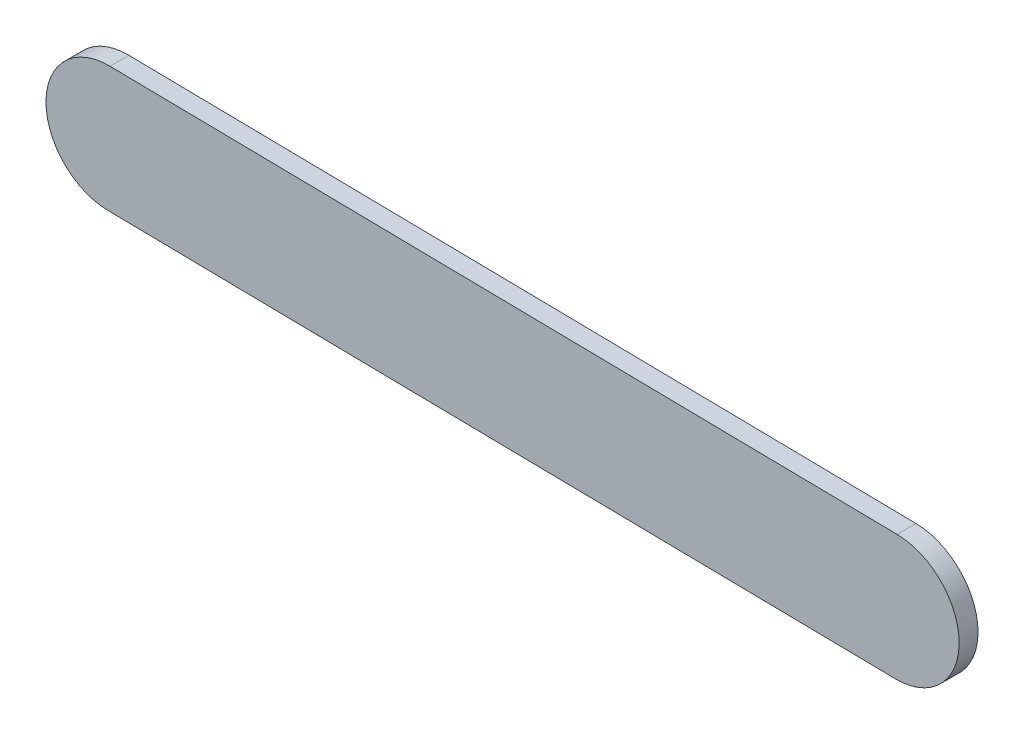
ISO-10303-21;
HEADER;
FILE_DESCRIPTION(('STEP AP214'),'2;1');
FILE_NAME('part.step','',(''),(''),'','','');
FILE_SCHEMA(('AUTOMOTIVE_DESIGN { 1 0 10303 214 1 1 1 1 }'));
ENDSEC;
DATA;
#1=APPLICATION_CONTEXT('core data for automotive mechanical design processes');
#2=APPLICATION_PROTOCOL_DEFINITION('international standard','automotive_design',2000,#1);
#3=PRODUCT_CONTEXT('',#1,'mechanical');
#4=PRODUCT('Part','Part','',(#3));
#5=PRODUCT_RELATED_PRODUCT_CATEGORY('part','',(#4));
#6=PRODUCT_DEFINITION_FORMATION('','',#4);
#7=PRODUCT_DEFINITION_CONTEXT('part definition',#1,'design');
#8=PRODUCT_DEFINITION('design','',#6,#7);
#9=PRODUCT_DEFINITION_SHAPE('','',#8);
#10=(LENGTH_UNIT() NAMED_UNIT(*) SI_UNIT(.MILLI.,.METRE.));
#11=(NAMED_UNIT(*) PLANE_ANGLE_UNIT() SI_UNIT($,.RADIAN.));
#12=(NAMED_UNIT(*) SI_UNIT($,.STERADIAN.) SOLID_ANGLE_UNIT());
#13=UNCERTAINTY_MEASURE_WITH_UNIT(LENGTH_MEASURE(1.E-05),#10,'distance_accuracy_value','');
#14=(GEOMETRIC_REPRESENTATION_CONTEXT(3) GLOBAL_UNCERTAINTY_ASSIGNED_CONTEXT((#13)) GLOBAL_UNIT_ASSIGNED_CONTEXT((#10,
#11,#12)) REPRESENTATION_CONTEXT('',''));
#15=CARTESIAN_POINT('',(0.,0.,0.));
#16=DIRECTION('',(0.,0.,1.));
#17=DIRECTION('',(1.,0.,0.));
#18=AXIS2_PLACEMENT_3D('',#15,#16,#17);
#19=CARTESIAN_POINT('',(53.1499966400594,-0.367507524123718,6.));
#20=DIRECTION('',(0.,0.,-1.));
#21=DIRECTION('',(-1.,0.,0.));
#22=AXIS2_PLACEMENT_3D('',#19,#20,#21);
#23=CYLINDRICAL_SURFACE('',#22,19.9999999999997);
#24=CARTESIAN_POINT('',(53.1499966400594,-0.367507524123718,0.));
#25=DIRECTION('',(0.,0.,1.));
#26=DIRECTION('',(-1.,0.,0.));
#27=AXIS2_PLACEMENT_3D('',#24,#25,#26);
#28=CIRCLE('',#27,19.9999999999997);
#29=CARTESIAN_POINT('',(53.4524787511718,19.6302049593691,0.));
#30=VERTEX_POINT('',#29);
#31=CARTESIAN_POINT('',(52.847514528947,-20.3652200076166,0.));
#32=VERTEX_POINT('',#31);
#33=EDGE_CURVE('E102',#30,#32,#28,.T.);
#34=ORIENTED_EDGE('',*,*,#33,.T.);
#35=DIRECTION('',(0.,0.,-1.));
#36=VECTOR('',#35,1.);
#37=CARTESIAN_POINT('',(52.847514528947,-20.3652200076166,6.));
#38=LINE('',#37,#36);
#39=CARTESIAN_POINT('',(52.847514528947,-20.3652200076166,6.));
#40=VERTEX_POINT('',#39);
#41=EDGE_CURVE('E11',#40,#32,#38,.T.);
#42=ORIENTED_EDGE('',*,*,#41,.F.);
#43=CARTESIAN_POINT('',(53.1499966400594,-0.367507524123718,6.));
#44=DIRECTION('',(0.,0.,1.));
#45=DIRECTION('',(-1.,0.,0.));
#46=AXIS2_PLACEMENT_3D('',#43,#44,#45);
#47=CIRCLE('',#46,19.9999999999997);
#48=CARTESIAN_POINT('',(53.4524787511718,19.6302049593691,6.));
#49=VERTEX_POINT('',#48);
#50=EDGE_CURVE('E90',#49,#40,#47,.T.);
#51=ORIENTED_EDGE('',*,*,#50,.F.);
#52=DIRECTION('',(0.,0.,-1.));
#53=VECTOR('',#52,1.);
#54=CARTESIAN_POINT('',(53.4524787511718,19.6302049593691,6.));
#55=LINE('',#54,#53);
#56=EDGE_CURVE('E98',#49,#30,#55,.T.);
#57=ORIENTED_EDGE('',*,*,#56,.T.);
#58=EDGE_LOOP('',(#34,#42,#51,#57));
#59=FACE_BOUND('',#58,.T.);
#60=ADVANCED_FACE('F39',(#59),#23,.T.);
#61=CARTESIAN_POINT('',(302.818923932551,-24.1462464473448,6.));
#62=DIRECTION('',(0.0151241055556253,0.999885624174657,0.));
#63=DIRECTION('',(-0.999885624174657,0.0151241055556253,0.));
#64=AXIS2_PLACEMENT_3D('',#61,#62,#63);
#65=PLANE('',#64);
#66=DIRECTION('',(0.999885624174656,-0.0151241055556253,0.));
#67=VECTOR('',#66,1.);
#68=CARTESIAN_POINT('',(302.818923932551,-24.1462464473448,0.));
#69=LINE('',#68,#67);
#70=CARTESIAN_POINT('',(302.818923932551,-24.1462464473448,0.));
#71=VERTEX_POINT('',#70);
#72=EDGE_CURVE('E94',#32,#71,#69,.T.);
#73=ORIENTED_EDGE('',*,*,#72,.T.);
#74=DIRECTION('',(0.,0.,-1.));
#75=VECTOR('',#74,1.);
#76=CARTESIAN_POINT('',(302.818923932551,-24.1462464473448,6.));
#77=LINE('',#76,#75);
#78=CARTESIAN_POINT('',(302.818923932551,-24.1462464473448,6.));
#79=VERTEX_POINT('',#78);
#80=EDGE_CURVE('E47',#79,#71,#77,.T.);
#81=ORIENTED_EDGE('',*,*,#80,.F.);
#82=DIRECTION('',(0.999885624174656,-0.0151241055556253,0.));
#83=VECTOR('',#82,1.);
#84=CARTESIAN_POINT('',(302.818923932551,-24.1462464473448,6.));
#85=LINE('',#84,#83);
#86=EDGE_CURVE('E85',#40,#79,#85,.T.);
#87=ORIENTED_EDGE('',*,*,#86,.F.);
#88=ORIENTED_EDGE('',*,*,#41,.T.);
#89=EDGE_LOOP('',(#73,#81,#87,#88));
#90=FACE_BOUND('',#89,.T.);
#91=ADVANCED_FACE('F93',(#90),#65,.F.);
#92=CARTESIAN_POINT('',(303.121406043663,-4.14853396385148,6.));
#93=DIRECTION('',(0.,0.,-1.));
#94=DIRECTION('',(-1.,0.,0.));
#95=AXIS2_PLACEMENT_3D('',#92,#93,#94);
#96=CYLINDRICAL_SURFACE('',#95,20.0000000000002);
#97=CARTESIAN_POINT('',(303.121406043663,-4.14853396385148,0.));
#98=DIRECTION('',(0.,0.,1.));
#99=DIRECTION('',(-1.,0.,0.));
#100=AXIS2_PLACEMENT_3D('',#97,#98,#99);
#101=CIRCLE('',#100,20.0000000000002);
#102=CARTESIAN_POINT('',(303.423888154776,15.8491785196418,0.));
#103=VERTEX_POINT('',#102);
#104=EDGE_CURVE('E72',#71,#103,#101,.T.);
#105=ORIENTED_EDGE('',*,*,#104,.T.);
#106=DIRECTION('',(0.,0.,-1.));
#107=VECTOR('',#106,1.);
#108=CARTESIAN_POINT('',(303.423888154776,15.8491785196418,6.));
#109=LINE('',#108,#107);
#110=CARTESIAN_POINT('',(303.423888154776,15.8491785196418,6.));
#111=VERTEX_POINT('',#110);
#112=EDGE_CURVE('E95',#111,#103,#109,.T.);
#113=ORIENTED_EDGE('',*,*,#112,.F.);
#114=CARTESIAN_POINT('',(303.121406043663,-4.14853396385148,6.));
#115=DIRECTION('',(0.,0.,1.));
#116=DIRECTION('',(-1.,0.,0.));
#117=AXIS2_PLACEMENT_3D('',#114,#115,#116);
#118=CIRCLE('',#117,20.0000000000002);
#119=EDGE_CURVE('E88',#79,#111,#118,.T.);
#120=ORIENTED_EDGE('',*,*,#119,.F.);
#121=ORIENTED_EDGE('',*,*,#80,.T.);
#122=EDGE_LOOP('',(#105,#113,#120,#121));
#123=FACE_BOUND('',#122,.T.);
#124=ADVANCED_FACE('F96',(#123),#96,.T.);
#125=CARTESIAN_POINT('',(53.4524787511718,19.6302049593691,6.));
#126=DIRECTION('',(-0.0151241055556216,-0.999885624174656,0.));
#127=DIRECTION('',(0.999885624174657,-0.0151241055556216,0.));
#128=AXIS2_PLACEMENT_3D('',#125,#126,#127);
#129=PLANE('',#128);
#130=DIRECTION('',(-0.999885624174657,0.0151241055556216,0.));
#131=VECTOR('',#130,1.);
#132=CARTESIAN_POINT('',(53.4524787511718,19.6302049593691,0.));
#133=LINE('',#132,#131);
#134=EDGE_CURVE('E78',#103,#30,#133,.T.);
#135=ORIENTED_EDGE('',*,*,#134,.T.);
#136=ORIENTED_EDGE('',*,*,#56,.F.);
#137=DIRECTION('',(-0.999885624174657,0.0151241055556216,0.));
#138=VECTOR('',#137,1.);
#139=CARTESIAN_POINT('',(53.4524787511718,19.6302049593691,6.));
#140=LINE('',#139,#138);
#141=EDGE_CURVE('E55',#111,#49,#140,.T.);
#142=ORIENTED_EDGE('',*,*,#141,.F.);
#143=ORIENTED_EDGE('',*,*,#112,.T.);
#144=EDGE_LOOP('',(#135,#136,#142,#143));
#145=FACE_BOUND('',#144,.T.);
#146=ADVANCED_FACE('F110',(#145),#129,.F.);
#147=CARTESIAN_POINT('',(53.1499966400594,-0.367507524123718,6.));
#148=DIRECTION('',(0.,0.,-1.));
#149=DIRECTION('',(-1.,0.,0.));
#150=AXIS2_PLACEMENT_3D('',#147,#148,#149);
#151=PLANE('',#150);
#152=ORIENTED_EDGE('',*,*,#50,.T.);
#153=ORIENTED_EDGE('',*,*,#86,.T.);
#154=ORIENTED_EDGE('',*,*,#119,.T.);
#155=ORIENTED_EDGE('',*,*,#141,.T.);
#156=EDGE_LOOP('',(#152,#153,#154,#155));
#157=FACE_BOUND('',#156,.T.);
#158=ADVANCED_FACE('F86',(#157),#151,.F.);
#159=CARTESIAN_POINT('',(53.1499966400594,-0.367507524123718,0.));
#160=DIRECTION('',(0.,0.,-1.));
#161=DIRECTION('',(-1.,0.,0.));
#162=AXIS2_PLACEMENT_3D('',#159,#160,#161);
#163=PLANE('',#162);
#164=CARTESIAN_POINT('',(53.1499966400595,-0.367507524123718,0.));
#165=DIRECTION('',(0.,0.,-1.));
#166=DIRECTION('',(-1.,0.,0.));
#167=AXIS2_PLACEMENT_3D('',#164,#165,#166);
#168=CIRCLE('',#167,12.2);
#169=CARTESIAN_POINT('',(40.9499966400595,-0.367507524123718,0.));
#170=VERTEX_POINT('',#169);
#171=EDGE_CURVE('E118',#170,#170,#168,.T.);
#172=ORIENTED_EDGE('',*,*,#171,.F.);
#173=EDGE_LOOP('',(#172));
#174=FACE_BOUND('',#173,.T.);
#175=ORIENTED_EDGE('',*,*,#33,.F.);
#176=ORIENTED_EDGE('',*,*,#134,.F.);
#177=ORIENTED_EDGE('',*,*,#104,.F.);
#178=ORIENTED_EDGE('',*,*,#72,.F.);
#179=EDGE_LOOP('',(#175,#176,#177,#178));
#180=FACE_BOUND('',#179,.T.);
#181=ADVANCED_FACE('F113',(#174,#180),#163,.T.);
#182=CARTESIAN_POINT('',(53.1499966400595,-0.367507524123718,-40.0068109219035));
#183=DIRECTION('',(0.,0.,1.));
#184=DIRECTION('',(1.,0.,0.));
#185=AXIS2_PLACEMENT_3D('',#182,#183,#184);
#186=CYLINDRICAL_SURFACE('',#185,12.2);
#187=ORIENTED_EDGE('',*,*,#171,.T.);
#188=EDGE_LOOP('',(#187));
#189=FACE_BOUND('',#188,.T.);
#190=CARTESIAN_POINT('',(53.1499966400595,-0.367507524123718,-5.25));
#191=DIRECTION('',(0.,0.,-1.));
#192=DIRECTION('',(-1.,0.,0.));
#193=AXIS2_PLACEMENT_3D('',#190,#191,#192);
#194=CIRCLE('',#193,12.2);
#195=CARTESIAN_POINT('',(40.9499966400595,-0.367507524123718,-5.25));
#196=VERTEX_POINT('',#195);
#197=EDGE_CURVE('E105',#196,#196,#194,.T.);
#198=ORIENTED_EDGE('',*,*,#197,.F.);
#199=EDGE_LOOP('',(#198));
#200=FACE_BOUND('',#199,.T.);
#201=ADVANCED_FACE('F122',(#189,#200),#186,.T.);
#202=CARTESIAN_POINT('',(54.790764094651,0.56278489097808,-5.25));
#203=DIRECTION('',(0.,0.,-1.));
#204=DIRECTION('',(-0.949332569207933,-0.314273245824497,0.));
#205=AXIS2_PLACEMENT_3D('',#202,#203,#204);
#206=PLANE('',#205);
#207=ORIENTED_EDGE('',*,*,#197,.T.);
#208=EDGE_LOOP('',(#207));
#209=FACE_BOUND('',#208,.T.);
#210=ADVANCED_FACE('F131',(#209),#206,.T.);
#211=CLOSED_SHELL('',(#60,#91,#124,#146,#158,#181,#201,#210));
#212=MANIFOLD_SOLID_BREP('B2',#211);
#213=ADVANCED_BREP_SHAPE_REPRESENTATION('',(#18,#212),#14);
#214=SHAPE_DEFINITION_REPRESENTATION(#9,#213);
ENDSEC;
END-ISO-10303-21;
